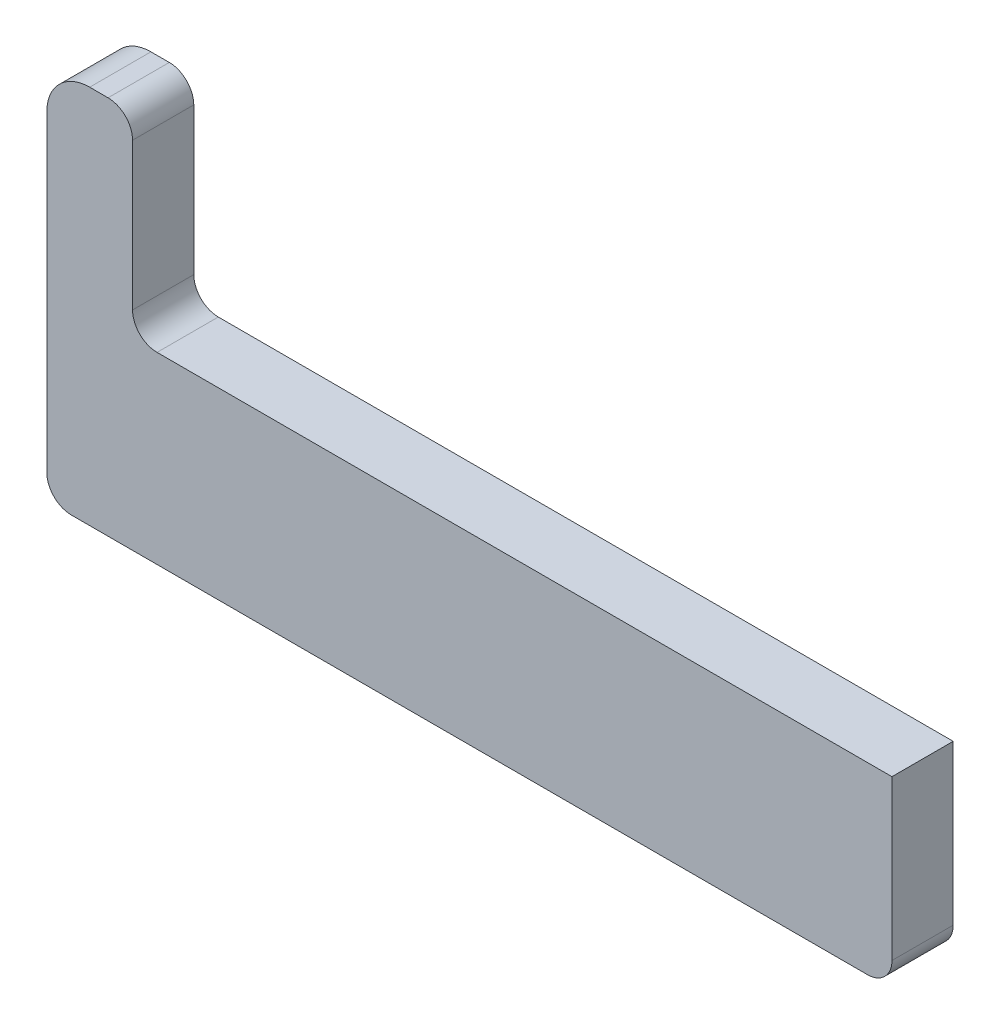
ISO-10303-21;
HEADER;
FILE_DESCRIPTION(('STEP AP214'),'2;1');
FILE_NAME('part.step','',(''),(''),'','','');
FILE_SCHEMA(('AUTOMOTIVE_DESIGN { 1 0 10303 214 1 1 1 1 }'));
ENDSEC;
DATA;
#1=APPLICATION_CONTEXT('core data for automotive mechanical design processes');
#2=APPLICATION_PROTOCOL_DEFINITION('international standard','automotive_design',2000,#1);
#3=PRODUCT_CONTEXT('',#1,'mechanical');
#4=PRODUCT('Part','Part','',(#3));
#5=PRODUCT_RELATED_PRODUCT_CATEGORY('part','',(#4));
#6=PRODUCT_DEFINITION_FORMATION('','',#4);
#7=PRODUCT_DEFINITION_CONTEXT('part definition',#1,'design');
#8=PRODUCT_DEFINITION('design','',#6,#7);
#9=PRODUCT_DEFINITION_SHAPE('','',#8);
#10=(LENGTH_UNIT() NAMED_UNIT(*) SI_UNIT(.MILLI.,.METRE.));
#11=(NAMED_UNIT(*) PLANE_ANGLE_UNIT() SI_UNIT($,.RADIAN.));
#12=(NAMED_UNIT(*) SI_UNIT($,.STERADIAN.) SOLID_ANGLE_UNIT());
#13=UNCERTAINTY_MEASURE_WITH_UNIT(LENGTH_MEASURE(1.E-05),#10,'distance_accuracy_value','');
#14=(GEOMETRIC_REPRESENTATION_CONTEXT(3) GLOBAL_UNCERTAINTY_ASSIGNED_CONTEXT((#13)) GLOBAL_UNIT_ASSIGNED_CONTEXT((#10,
#11,#12)) REPRESENTATION_CONTEXT('',''));
#15=CARTESIAN_POINT('',(0.,0.,0.));
#16=DIRECTION('',(0.,0.,1.));
#17=DIRECTION('',(1.,0.,0.));
#18=AXIS2_PLACEMENT_3D('',#15,#16,#17);
#19=CARTESIAN_POINT('',(-65.5,27.5,5.));
#20=DIRECTION('',(0.,0.,-1.));
#21=DIRECTION('',(-1.,0.,0.));
#22=AXIS2_PLACEMENT_3D('',#19,#20,#21);
#23=CYLINDRICAL_SURFACE('',#22,3.5);
#24=CARTESIAN_POINT('',(-65.5,27.5,0.));
#25=DIRECTION('',(0.,0.,1.));
#26=DIRECTION('',(-1.,0.,0.));
#27=AXIS2_PLACEMENT_3D('',#24,#25,#26);
#28=CIRCLE('',#27,3.5);
#29=CARTESIAN_POINT('',(-65.5,31.,0.));
#30=VERTEX_POINT('',#29);
#31=CARTESIAN_POINT('',(-69.,27.5,0.));
#32=VERTEX_POINT('',#31);
#33=EDGE_CURVE('E147',#30,#32,#28,.T.);
#34=ORIENTED_EDGE('',*,*,#33,.T.);
#35=DIRECTION('',(0.,0.,-1.));
#36=VECTOR('',#35,1.);
#37=CARTESIAN_POINT('',(-69.,27.5,5.));
#38=LINE('',#37,#36);
#39=CARTESIAN_POINT('',(-69.,27.5,5.));
#40=VERTEX_POINT('',#39);
#41=EDGE_CURVE('E11',#40,#32,#38,.T.);
#42=ORIENTED_EDGE('',*,*,#41,.F.);
#43=CARTESIAN_POINT('',(-65.5,27.5,5.));
#44=DIRECTION('',(0.,0.,1.));
#45=DIRECTION('',(-1.,0.,0.));
#46=AXIS2_PLACEMENT_3D('',#43,#44,#45);
#47=CIRCLE('',#46,3.5);
#48=CARTESIAN_POINT('',(-65.5,31.,5.));
#49=VERTEX_POINT('',#48);
#50=EDGE_CURVE('E167',#49,#40,#47,.T.);
#51=ORIENTED_EDGE('',*,*,#50,.F.);
#52=DIRECTION('',(0.,0.,-1.));
#53=VECTOR('',#52,1.);
#54=CARTESIAN_POINT('',(-65.5,31.,5.));
#55=LINE('',#54,#53);
#56=EDGE_CURVE('E143',#49,#30,#55,.T.);
#57=ORIENTED_EDGE('',*,*,#56,.T.);
#58=EDGE_LOOP('',(#34,#42,#51,#57));
#59=FACE_BOUND('',#58,.T.);
#60=ADVANCED_FACE('F33',(#59),#23,.T.);
#61=CARTESIAN_POINT('',(-69.,2.00000000000001,5.));
#62=DIRECTION('',(1.,0.,0.));
#63=DIRECTION('',(0.,0.,-1.));
#64=AXIS2_PLACEMENT_3D('',#61,#62,#63);
#65=PLANE('',#64);
#66=DIRECTION('',(0.,-1.,0.));
#67=VECTOR('',#66,1.);
#68=CARTESIAN_POINT('',(-69.,2.00000000000001,0.));
#69=LINE('',#68,#67);
#70=CARTESIAN_POINT('',(-69.,2.00000000000001,0.));
#71=VERTEX_POINT('',#70);
#72=EDGE_CURVE('E150',#32,#71,#69,.T.);
#73=ORIENTED_EDGE('',*,*,#72,.T.);
#74=DIRECTION('',(0.,0.,-1.));
#75=VECTOR('',#74,1.);
#76=CARTESIAN_POINT('',(-69.,2.00000000000001,5.));
#77=LINE('',#76,#75);
#78=CARTESIAN_POINT('',(-69.,2.00000000000001,5.));
#79=VERTEX_POINT('',#78);
#80=EDGE_CURVE('E41',#79,#71,#77,.T.);
#81=ORIENTED_EDGE('',*,*,#80,.F.);
#82=DIRECTION('',(0.,-1.,0.));
#83=VECTOR('',#82,1.);
#84=CARTESIAN_POINT('',(-69.,2.00000000000001,5.));
#85=LINE('',#84,#83);
#86=EDGE_CURVE('E101',#40,#79,#85,.T.);
#87=ORIENTED_EDGE('',*,*,#86,.F.);
#88=ORIENTED_EDGE('',*,*,#41,.T.);
#89=EDGE_LOOP('',(#73,#81,#87,#88));
#90=FACE_BOUND('',#89,.T.);
#91=ADVANCED_FACE('F239',(#90),#65,.F.);
#92=CARTESIAN_POINT('',(-67.,2.,5.));
#93=DIRECTION('',(0.,0.,-1.));
#94=DIRECTION('',(-1.,0.,0.));
#95=AXIS2_PLACEMENT_3D('',#92,#93,#94);
#96=CYLINDRICAL_SURFACE('',#95,2.);
#97=CARTESIAN_POINT('',(-67.,2.,0.));
#98=DIRECTION('',(0.,0.,1.));
#99=DIRECTION('',(-1.,0.,0.));
#100=AXIS2_PLACEMENT_3D('',#97,#98,#99);
#101=CIRCLE('',#100,2.);
#102=CARTESIAN_POINT('',(-67.,0.,0.));
#103=VERTEX_POINT('',#102);
#104=EDGE_CURVE('E152',#71,#103,#101,.T.);
#105=ORIENTED_EDGE('',*,*,#104,.T.);
#106=DIRECTION('',(0.,0.,-1.));
#107=VECTOR('',#106,1.);
#108=CARTESIAN_POINT('',(-67.,0.,5.));
#109=LINE('',#108,#107);
#110=CARTESIAN_POINT('',(-67.,0.,5.));
#111=VERTEX_POINT('',#110);
#112=EDGE_CURVE('E183',#111,#103,#109,.T.);
#113=ORIENTED_EDGE('',*,*,#112,.F.);
#114=CARTESIAN_POINT('',(-67.,2.,5.));
#115=DIRECTION('',(0.,0.,1.));
#116=DIRECTION('',(-1.,0.,0.));
#117=AXIS2_PLACEMENT_3D('',#114,#115,#116);
#118=CIRCLE('',#117,2.);
#119=EDGE_CURVE('E191',#79,#111,#118,.T.);
#120=ORIENTED_EDGE('',*,*,#119,.F.);
#121=ORIENTED_EDGE('',*,*,#80,.T.);
#122=EDGE_LOOP('',(#105,#113,#120,#121));
#123=FACE_BOUND('',#122,.T.);
#124=ADVANCED_FACE('F189',(#123),#96,.T.);
#125=CARTESIAN_POINT('',(-2.00000000000001,0.,5.));
#126=DIRECTION('',(0.,1.,0.));
#127=DIRECTION('',(0.,0.,1.));
#128=AXIS2_PLACEMENT_3D('',#125,#126,#127);
#129=PLANE('',#128);
#130=DIRECTION('',(1.,0.,0.));
#131=VECTOR('',#130,1.);
#132=CARTESIAN_POINT('',(-2.00000000000001,0.,0.));
#133=LINE('',#132,#131);
#134=CARTESIAN_POINT('',(-2.00000000000001,0.,0.));
#135=VERTEX_POINT('',#134);
#136=EDGE_CURVE('E154',#103,#135,#133,.T.);
#137=ORIENTED_EDGE('',*,*,#136,.T.);
#138=DIRECTION('',(0.,0.,-1.));
#139=VECTOR('',#138,1.);
#140=CARTESIAN_POINT('',(-2.00000000000001,0.,5.));
#141=LINE('',#140,#139);
#142=CARTESIAN_POINT('',(-2.00000000000001,0.,5.));
#143=VERTEX_POINT('',#142);
#144=EDGE_CURVE('E180',#143,#135,#141,.T.);
#145=ORIENTED_EDGE('',*,*,#144,.F.);
#146=DIRECTION('',(1.,0.,0.));
#147=VECTOR('',#146,1.);
#148=CARTESIAN_POINT('',(-2.00000000000001,0.,5.));
#149=LINE('',#148,#147);
#150=EDGE_CURVE('E209',#111,#143,#149,.T.);
#151=ORIENTED_EDGE('',*,*,#150,.F.);
#152=ORIENTED_EDGE('',*,*,#112,.T.);
#153=EDGE_LOOP('',(#137,#145,#151,#152));
#154=FACE_BOUND('',#153,.T.);
#155=ADVANCED_FACE('F200',(#154),#129,.F.);
#156=CARTESIAN_POINT('',(-2.,2.,5.));
#157=DIRECTION('',(0.,0.,-1.));
#158=DIRECTION('',(-1.,0.,0.));
#159=AXIS2_PLACEMENT_3D('',#156,#157,#158);
#160=CYLINDRICAL_SURFACE('',#159,2.);
#161=CARTESIAN_POINT('',(-2.,2.,0.));
#162=DIRECTION('',(0.,0.,1.));
#163=DIRECTION('',(1.,0.,0.));
#164=AXIS2_PLACEMENT_3D('',#161,#162,#163);
#165=CIRCLE('',#164,2.);
#166=CARTESIAN_POINT('',(0.,2.,0.));
#167=VERTEX_POINT('',#166);
#168=EDGE_CURVE('E156',#135,#167,#165,.T.);
#169=ORIENTED_EDGE('',*,*,#168,.T.);
#170=DIRECTION('',(0.,0.,-1.));
#171=VECTOR('',#170,1.);
#172=CARTESIAN_POINT('',(0.,2.,5.));
#173=LINE('',#172,#171);
#174=CARTESIAN_POINT('',(0.,2.,5.));
#175=VERTEX_POINT('',#174);
#176=EDGE_CURVE('E177',#175,#167,#173,.T.);
#177=ORIENTED_EDGE('',*,*,#176,.F.);
#178=CARTESIAN_POINT('',(-2.,2.,5.));
#179=DIRECTION('',(0.,0.,1.));
#180=DIRECTION('',(1.,0.,0.));
#181=AXIS2_PLACEMENT_3D('',#178,#179,#180);
#182=CIRCLE('',#181,2.);
#183=EDGE_CURVE('E206',#143,#175,#182,.T.);
#184=ORIENTED_EDGE('',*,*,#183,.F.);
#185=ORIENTED_EDGE('',*,*,#144,.T.);
#186=EDGE_LOOP('',(#169,#177,#184,#185));
#187=FACE_BOUND('',#186,.T.);
#188=ADVANCED_FACE('F204',(#187),#160,.T.);
#189=CARTESIAN_POINT('',(0.,15.,5.));
#190=DIRECTION('',(-1.,0.,0.));
#191=DIRECTION('',(0.,-1.,0.));
#192=AXIS2_PLACEMENT_3D('',#189,#190,#191);
#193=PLANE('',#192);
#194=DIRECTION('',(0.,1.,0.));
#195=VECTOR('',#194,1.);
#196=CARTESIAN_POINT('',(0.,15.,0.));
#197=LINE('',#196,#195);
#198=CARTESIAN_POINT('',(0.,15.,0.));
#199=VERTEX_POINT('',#198);
#200=EDGE_CURVE('E158',#167,#199,#197,.T.);
#201=ORIENTED_EDGE('',*,*,#200,.T.);
#202=DIRECTION('',(0.,0.,-1.));
#203=VECTOR('',#202,1.);
#204=CARTESIAN_POINT('',(0.,15.,5.));
#205=LINE('',#204,#203);
#206=CARTESIAN_POINT('',(0.,15.,5.));
#207=VERTEX_POINT('',#206);
#208=EDGE_CURVE('E174',#207,#199,#205,.T.);
#209=ORIENTED_EDGE('',*,*,#208,.F.);
#210=DIRECTION('',(0.,1.,0.));
#211=VECTOR('',#210,1.);
#212=CARTESIAN_POINT('',(0.,15.,5.));
#213=LINE('',#212,#211);
#214=EDGE_CURVE('E208',#175,#207,#213,.T.);
#215=ORIENTED_EDGE('',*,*,#214,.F.);
#216=ORIENTED_EDGE('',*,*,#176,.T.);
#217=EDGE_LOOP('',(#201,#209,#215,#216));
#218=FACE_BOUND('',#217,.T.);
#219=ADVANCED_FACE('F252',(#218),#193,.F.);
#220=CARTESIAN_POINT('',(-60.,15.,5.));
#221=DIRECTION('',(0.,-1.,0.));
#222=DIRECTION('',(0.,0.,-1.));
#223=AXIS2_PLACEMENT_3D('',#220,#221,#222);
#224=PLANE('',#223);
#225=DIRECTION('',(-1.,0.,0.));
#226=VECTOR('',#225,1.);
#227=CARTESIAN_POINT('',(-60.,15.,0.));
#228=LINE('',#227,#226);
#229=CARTESIAN_POINT('',(-60.,15.,0.));
#230=VERTEX_POINT('',#229);
#231=EDGE_CURVE('E160',#199,#230,#228,.T.);
#232=ORIENTED_EDGE('',*,*,#231,.T.);
#233=DIRECTION('',(0.,0.,-1.));
#234=VECTOR('',#233,1.);
#235=CARTESIAN_POINT('',(-60.,15.,5.));
#236=LINE('',#235,#234);
#237=CARTESIAN_POINT('',(-60.,15.,5.));
#238=VERTEX_POINT('',#237);
#239=EDGE_CURVE('E171',#238,#230,#236,.T.);
#240=ORIENTED_EDGE('',*,*,#239,.F.);
#241=DIRECTION('',(-1.,0.,0.));
#242=VECTOR('',#241,1.);
#243=CARTESIAN_POINT('',(-60.,15.,5.));
#244=LINE('',#243,#242);
#245=EDGE_CURVE('E211',#207,#238,#244,.T.);
#246=ORIENTED_EDGE('',*,*,#245,.F.);
#247=ORIENTED_EDGE('',*,*,#208,.T.);
#248=EDGE_LOOP('',(#232,#240,#246,#247));
#249=FACE_BOUND('',#248,.T.);
#250=ADVANCED_FACE('F220',(#249),#224,.F.);
#251=CARTESIAN_POINT('',(-60.,17.,5.));
#252=DIRECTION('',(0.,0.,-1.));
#253=DIRECTION('',(-1.,0.,0.));
#254=AXIS2_PLACEMENT_3D('',#251,#252,#253);
#255=CYLINDRICAL_SURFACE('',#254,2.);
#256=CARTESIAN_POINT('',(-60.,17.,0.));
#257=DIRECTION('',(0.,0.,-1.));
#258=DIRECTION('',(1.,0.,0.));
#259=AXIS2_PLACEMENT_3D('',#256,#257,#258);
#260=CIRCLE('',#259,2.);
#261=CARTESIAN_POINT('',(-62.,17.,0.));
#262=VERTEX_POINT('',#261);
#263=EDGE_CURVE('E162',#230,#262,#260,.T.);
#264=ORIENTED_EDGE('',*,*,#263,.T.);
#265=DIRECTION('',(0.,0.,-1.));
#266=VECTOR('',#265,1.);
#267=CARTESIAN_POINT('',(-62.,17.,5.));
#268=LINE('',#267,#266);
#269=CARTESIAN_POINT('',(-62.,17.,5.));
#270=VERTEX_POINT('',#269);
#271=EDGE_CURVE('E138',#270,#262,#268,.T.);
#272=ORIENTED_EDGE('',*,*,#271,.F.);
#273=CARTESIAN_POINT('',(-60.,17.,5.));
#274=DIRECTION('',(0.,0.,-1.));
#275=DIRECTION('',(1.,0.,0.));
#276=AXIS2_PLACEMENT_3D('',#273,#274,#275);
#277=CIRCLE('',#276,2.);
#278=EDGE_CURVE('E129',#238,#270,#277,.T.);
#279=ORIENTED_EDGE('',*,*,#278,.F.);
#280=ORIENTED_EDGE('',*,*,#239,.T.);
#281=EDGE_LOOP('',(#264,#272,#279,#280));
#282=FACE_BOUND('',#281,.T.);
#283=ADVANCED_FACE('F224',(#282),#255,.F.);
#284=CARTESIAN_POINT('',(-62.,29.,5.));
#285=DIRECTION('',(-1.,0.,0.));
#286=DIRECTION('',(0.,-1.,0.));
#287=AXIS2_PLACEMENT_3D('',#284,#285,#286);
#288=PLANE('',#287);
#289=DIRECTION('',(0.,1.,0.));
#290=VECTOR('',#289,1.);
#291=CARTESIAN_POINT('',(-62.,29.,0.));
#292=LINE('',#291,#290);
#293=CARTESIAN_POINT('',(-62.,29.,0.));
#294=VERTEX_POINT('',#293);
#295=EDGE_CURVE('E137',#262,#294,#292,.T.);
#296=ORIENTED_EDGE('',*,*,#295,.T.);
#297=DIRECTION('',(0.,0.,-1.));
#298=VECTOR('',#297,1.);
#299=CARTESIAN_POINT('',(-62.,29.,5.));
#300=LINE('',#299,#298);
#301=CARTESIAN_POINT('',(-62.,29.,5.));
#302=VERTEX_POINT('',#301);
#303=EDGE_CURVE('E134',#302,#294,#300,.T.);
#304=ORIENTED_EDGE('',*,*,#303,.F.);
#305=DIRECTION('',(0.,1.,0.));
#306=VECTOR('',#305,1.);
#307=CARTESIAN_POINT('',(-62.,29.,5.));
#308=LINE('',#307,#306);
#309=EDGE_CURVE('E123',#270,#302,#308,.T.);
#310=ORIENTED_EDGE('',*,*,#309,.F.);
#311=ORIENTED_EDGE('',*,*,#271,.T.);
#312=EDGE_LOOP('',(#296,#304,#310,#311));
#313=FACE_BOUND('',#312,.T.);
#314=ADVANCED_FACE('F135',(#313),#288,.F.);
#315=CARTESIAN_POINT('',(-64.,29.,5.));
#316=DIRECTION('',(0.,0.,-1.));
#317=DIRECTION('',(-1.,0.,0.));
#318=AXIS2_PLACEMENT_3D('',#315,#316,#317);
#319=CYLINDRICAL_SURFACE('',#318,2.);
#320=CARTESIAN_POINT('',(-64.,29.,0.));
#321=DIRECTION('',(0.,0.,1.));
#322=DIRECTION('',(-1.,0.,0.));
#323=AXIS2_PLACEMENT_3D('',#320,#321,#322);
#324=CIRCLE('',#323,2.);
#325=CARTESIAN_POINT('',(-64.,31.,0.));
#326=VERTEX_POINT('',#325);
#327=EDGE_CURVE('E87',#294,#326,#324,.T.);
#328=ORIENTED_EDGE('',*,*,#327,.T.);
#329=DIRECTION('',(0.,0.,-1.));
#330=VECTOR('',#329,1.);
#331=CARTESIAN_POINT('',(-64.,31.,5.));
#332=LINE('',#331,#330);
#333=CARTESIAN_POINT('',(-64.,31.,5.));
#334=VERTEX_POINT('',#333);
#335=EDGE_CURVE('E139',#334,#326,#332,.T.);
#336=ORIENTED_EDGE('',*,*,#335,.F.);
#337=CARTESIAN_POINT('',(-64.,29.,5.));
#338=DIRECTION('',(0.,0.,1.));
#339=DIRECTION('',(-1.,0.,0.));
#340=AXIS2_PLACEMENT_3D('',#337,#338,#339);
#341=CIRCLE('',#340,2.);
#342=EDGE_CURVE('E127',#302,#334,#341,.T.);
#343=ORIENTED_EDGE('',*,*,#342,.F.);
#344=ORIENTED_EDGE('',*,*,#303,.T.);
#345=EDGE_LOOP('',(#328,#336,#343,#344));
#346=FACE_BOUND('',#345,.T.);
#347=ADVANCED_FACE('F141',(#346),#319,.T.);
#348=CARTESIAN_POINT('',(-65.5,31.,5.));
#349=DIRECTION('',(0.,-1.,0.));
#350=DIRECTION('',(0.,0.,-1.));
#351=AXIS2_PLACEMENT_3D('',#348,#349,#350);
#352=PLANE('',#351);
#353=DIRECTION('',(-1.,0.,0.));
#354=VECTOR('',#353,1.);
#355=CARTESIAN_POINT('',(-65.5,31.,0.));
#356=LINE('',#355,#354);
#357=EDGE_CURVE('E93',#326,#30,#356,.T.);
#358=ORIENTED_EDGE('',*,*,#357,.T.);
#359=ORIENTED_EDGE('',*,*,#56,.F.);
#360=DIRECTION('',(-1.,0.,0.));
#361=VECTOR('',#360,1.);
#362=CARTESIAN_POINT('',(-65.5,31.,5.));
#363=LINE('',#362,#361);
#364=EDGE_CURVE('E49',#334,#49,#363,.T.);
#365=ORIENTED_EDGE('',*,*,#364,.F.);
#366=ORIENTED_EDGE('',*,*,#335,.T.);
#367=EDGE_LOOP('',(#358,#359,#365,#366));
#368=FACE_BOUND('',#367,.T.);
#369=ADVANCED_FACE('F228',(#368),#352,.F.);
#370=CARTESIAN_POINT('',(-65.5,27.5,5.));
#371=DIRECTION('',(0.,0.,-1.));
#372=DIRECTION('',(-1.,0.,0.));
#373=AXIS2_PLACEMENT_3D('',#370,#371,#372);
#374=PLANE('',#373);
#375=ORIENTED_EDGE('',*,*,#50,.T.);
#376=ORIENTED_EDGE('',*,*,#86,.T.);
#377=ORIENTED_EDGE('',*,*,#119,.T.);
#378=ORIENTED_EDGE('',*,*,#150,.T.);
#379=ORIENTED_EDGE('',*,*,#183,.T.);
#380=ORIENTED_EDGE('',*,*,#214,.T.);
#381=ORIENTED_EDGE('',*,*,#245,.T.);
#382=ORIENTED_EDGE('',*,*,#278,.T.);
#383=ORIENTED_EDGE('',*,*,#309,.T.);
#384=ORIENTED_EDGE('',*,*,#342,.T.);
#385=ORIENTED_EDGE('',*,*,#364,.T.);
#386=EDGE_LOOP('',(#375,#376,#377,#378,#379,#380,#381,#382,#383,#384,#385));
#387=FACE_BOUND('',#386,.T.);
#388=ADVANCED_FACE('F125',(#387),#374,.F.);
#389=CARTESIAN_POINT('',(-65.5,27.5,0.));
#390=DIRECTION('',(0.,0.,-1.));
#391=DIRECTION('',(-1.,0.,0.));
#392=AXIS2_PLACEMENT_3D('',#389,#390,#391);
#393=PLANE('',#392);
#394=ORIENTED_EDGE('',*,*,#33,.F.);
#395=ORIENTED_EDGE('',*,*,#357,.F.);
#396=ORIENTED_EDGE('',*,*,#327,.F.);
#397=ORIENTED_EDGE('',*,*,#295,.F.);
#398=ORIENTED_EDGE('',*,*,#263,.F.);
#399=ORIENTED_EDGE('',*,*,#231,.F.);
#400=ORIENTED_EDGE('',*,*,#200,.F.);
#401=ORIENTED_EDGE('',*,*,#168,.F.);
#402=ORIENTED_EDGE('',*,*,#136,.F.);
#403=ORIENTED_EDGE('',*,*,#104,.F.);
#404=ORIENTED_EDGE('',*,*,#72,.F.);
#405=EDGE_LOOP('',(#394,#395,#396,#397,#398,#399,#400,#401,#402,#403,#404));
#406=FACE_BOUND('',#405,.T.);
#407=ADVANCED_FACE('F195',(#406),#393,.T.);
#408=CLOSED_SHELL('',(#60,#91,#124,#155,#188,#219,#250,#283,#314,#347,#369,#388,#407));
#409=MANIFOLD_SOLID_BREP('B2',#408);
#410=ADVANCED_BREP_SHAPE_REPRESENTATION('',(#18,#409),#14);
#411=SHAPE_DEFINITION_REPRESENTATION(#9,#410);
ENDSEC;
END-ISO-10303-21;
